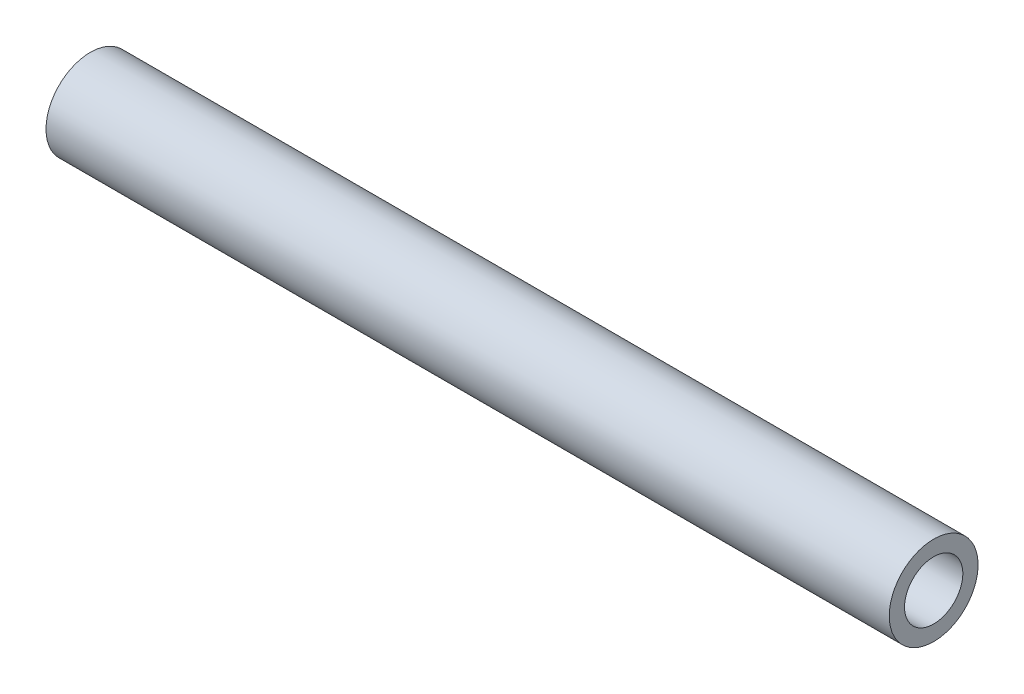
ISO-10303-21;
HEADER;
FILE_DESCRIPTION(('STEP AP214'),'2;1');
FILE_NAME('part.step','',(''),(''),'','','');
FILE_SCHEMA(('AUTOMOTIVE_DESIGN { 1 0 10303 214 1 1 1 1 }'));
ENDSEC;
DATA;
#1=APPLICATION_CONTEXT('core data for automotive mechanical design processes');
#2=APPLICATION_PROTOCOL_DEFINITION('international standard','automotive_design',2000,#1);
#3=PRODUCT_CONTEXT('',#1,'mechanical');
#4=PRODUCT('Part','Part','',(#3));
#5=PRODUCT_RELATED_PRODUCT_CATEGORY('part','',(#4));
#6=PRODUCT_DEFINITION_FORMATION('','',#4);
#7=PRODUCT_DEFINITION_CONTEXT('part definition',#1,'design');
#8=PRODUCT_DEFINITION('design','',#6,#7);
#9=PRODUCT_DEFINITION_SHAPE('','',#8);
#10=(LENGTH_UNIT() NAMED_UNIT(*) SI_UNIT(.MILLI.,.METRE.));
#11=(NAMED_UNIT(*) PLANE_ANGLE_UNIT() SI_UNIT($,.RADIAN.));
#12=(NAMED_UNIT(*) SI_UNIT($,.STERADIAN.) SOLID_ANGLE_UNIT());
#13=UNCERTAINTY_MEASURE_WITH_UNIT(LENGTH_MEASURE(1.E-05),#10,'distance_accuracy_value','');
#14=(GEOMETRIC_REPRESENTATION_CONTEXT(3) GLOBAL_UNCERTAINTY_ASSIGNED_CONTEXT((#13)) GLOBAL_UNIT_ASSIGNED_CONTEXT((#10,
#11,#12)) REPRESENTATION_CONTEXT('',''));
#15=CARTESIAN_POINT('',(0.,0.,0.));
#16=DIRECTION('',(0.,0.,1.));
#17=DIRECTION('',(1.,0.,0.));
#18=AXIS2_PLACEMENT_3D('',#15,#16,#17);
#19=CARTESIAN_POINT('',(45.212,0.,0.));
#20=DIRECTION('',(-1.,0.,0.));
#21=DIRECTION('',(0.,0.,1.));
#22=AXIS2_PLACEMENT_3D('',#19,#20,#21);
#23=CYLINDRICAL_SURFACE('',#22,1.5621);
#24=CARTESIAN_POINT('',(0.,0.,0.));
#25=DIRECTION('',(-1.,0.,0.));
#26=DIRECTION('',(0.,0.,1.));
#27=AXIS2_PLACEMENT_3D('',#24,#25,#26);
#28=CIRCLE('',#27,1.5621);
#29=CARTESIAN_POINT('',(0.,0.,1.5621));
#30=VERTEX_POINT('',#29);
#31=EDGE_CURVE('E27',#30,#30,#28,.T.);
#32=ORIENTED_EDGE('',*,*,#31,.T.);
#33=EDGE_LOOP('',(#32));
#34=FACE_BOUND('',#33,.T.);
#35=CARTESIAN_POINT('',(45.212,0.,0.));
#36=DIRECTION('',(-1.,0.,0.));
#37=DIRECTION('',(0.,0.,1.));
#38=AXIS2_PLACEMENT_3D('',#35,#36,#37);
#39=CIRCLE('',#38,1.5621);
#40=CARTESIAN_POINT('',(45.212,0.,1.5621));
#41=VERTEX_POINT('',#40);
#42=EDGE_CURVE('E18',#41,#41,#39,.T.);
#43=ORIENTED_EDGE('',*,*,#42,.F.);
#44=EDGE_LOOP('',(#43));
#45=FACE_BOUND('',#44,.T.);
#46=ADVANCED_FACE('F15',(#34,#45),#23,.F.);
#47=CARTESIAN_POINT('',(45.212,0.,0.));
#48=DIRECTION('',(1.,0.,0.));
#49=DIRECTION('',(0.,0.,-1.));
#50=AXIS2_PLACEMENT_3D('',#47,#48,#49);
#51=PLANE('',#50);
#52=ORIENTED_EDGE('',*,*,#42,.T.);
#53=EDGE_LOOP('',(#52));
#54=FACE_BOUND('',#53,.T.);
#55=CARTESIAN_POINT('',(45.212,0.,0.));
#56=DIRECTION('',(-1.,0.,0.));
#57=DIRECTION('',(0.,0.,1.));
#58=AXIS2_PLACEMENT_3D('',#55,#56,#57);
#59=CIRCLE('',#58,2.38125);
#60=CARTESIAN_POINT('',(45.212,0.,2.38125));
#61=VERTEX_POINT('',#60);
#62=EDGE_CURVE('E22',#61,#61,#59,.T.);
#63=ORIENTED_EDGE('',*,*,#62,.F.);
#64=EDGE_LOOP('',(#63));
#65=FACE_BOUND('',#64,.T.);
#66=ADVANCED_FACE('F35',(#54,#65),#51,.T.);
#67=CARTESIAN_POINT('',(0.,0.,0.));
#68=DIRECTION('',(1.,0.,0.));
#69=DIRECTION('',(0.,0.,-1.));
#70=AXIS2_PLACEMENT_3D('',#67,#68,#69);
#71=PLANE('',#70);
#72=ORIENTED_EDGE('',*,*,#31,.F.);
#73=EDGE_LOOP('',(#72));
#74=FACE_BOUND('',#73,.T.);
#75=CARTESIAN_POINT('',(0.,0.,0.));
#76=DIRECTION('',(-1.,0.,0.));
#77=DIRECTION('',(0.,0.,1.));
#78=AXIS2_PLACEMENT_3D('',#75,#76,#77);
#79=CIRCLE('',#78,2.38125);
#80=CARTESIAN_POINT('',(0.,0.,2.38125));
#81=VERTEX_POINT('',#80);
#82=EDGE_CURVE('E10',#81,#81,#79,.F.);
#83=ORIENTED_EDGE('',*,*,#82,.F.);
#84=EDGE_LOOP('',(#83));
#85=FACE_BOUND('',#84,.T.);
#86=ADVANCED_FACE('F43',(#74,#85),#71,.F.);
#87=CARTESIAN_POINT('',(45.212,0.,0.));
#88=DIRECTION('',(-1.,0.,0.));
#89=DIRECTION('',(0.,0.,1.));
#90=AXIS2_PLACEMENT_3D('',#87,#88,#89);
#91=CYLINDRICAL_SURFACE('',#90,2.38125);
#92=ORIENTED_EDGE('',*,*,#82,.T.);
#93=EDGE_LOOP('',(#92));
#94=FACE_BOUND('',#93,.T.);
#95=ORIENTED_EDGE('',*,*,#62,.T.);
#96=EDGE_LOOP('',(#95));
#97=FACE_BOUND('',#96,.T.);
#98=ADVANCED_FACE('F44',(#94,#97),#91,.T.);
#99=CLOSED_SHELL('',(#46,#66,#86,#98));
#100=MANIFOLD_SOLID_BREP('B1',#99);
#101=ADVANCED_BREP_SHAPE_REPRESENTATION('',(#18,#100),#14);
#102=SHAPE_DEFINITION_REPRESENTATION(#9,#101);
ENDSEC;
END-ISO-10303-21;
